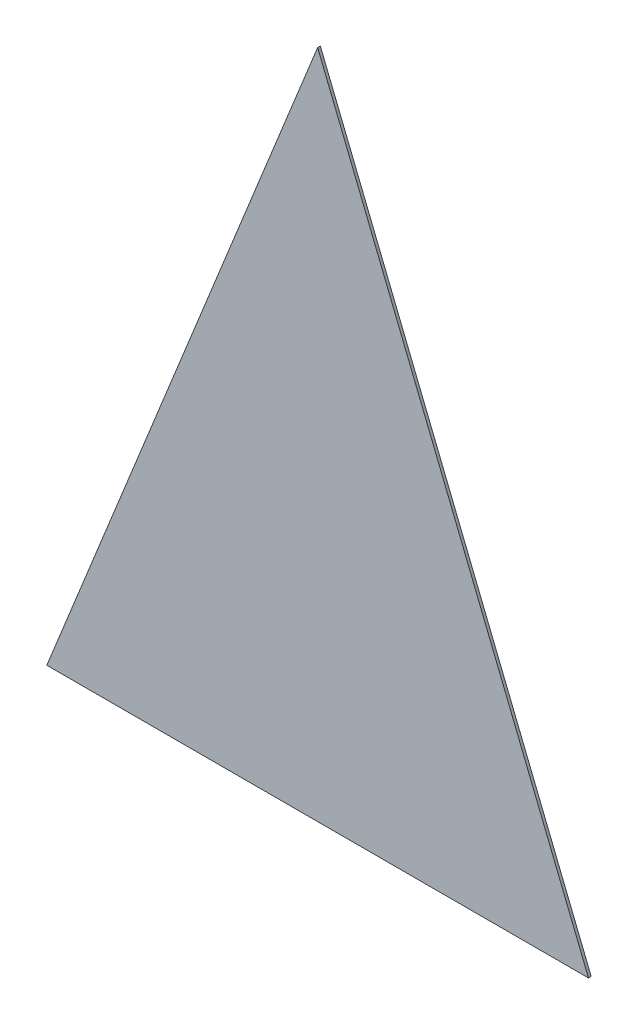
ISO-10303-21;
HEADER;
FILE_DESCRIPTION(('STEP AP214'),'2;1');
FILE_NAME('part.step','',(''),(''),'','','');
FILE_SCHEMA(('AUTOMOTIVE_DESIGN { 1 0 10303 214 1 1 1 1 }'));
ENDSEC;
DATA;
#1=APPLICATION_CONTEXT('core data for automotive mechanical design processes');
#2=APPLICATION_PROTOCOL_DEFINITION('international standard','automotive_design',2000,#1);
#3=PRODUCT_CONTEXT('',#1,'mechanical');
#4=PRODUCT('Part','Part','',(#3));
#5=PRODUCT_RELATED_PRODUCT_CATEGORY('part','',(#4));
#6=PRODUCT_DEFINITION_FORMATION('','',#4);
#7=PRODUCT_DEFINITION_CONTEXT('part definition',#1,'design');
#8=PRODUCT_DEFINITION('design','',#6,#7);
#9=PRODUCT_DEFINITION_SHAPE('','',#8);
#10=(LENGTH_UNIT() NAMED_UNIT(*) SI_UNIT(.MILLI.,.METRE.));
#11=(NAMED_UNIT(*) PLANE_ANGLE_UNIT() SI_UNIT($,.RADIAN.));
#12=(NAMED_UNIT(*) SI_UNIT($,.STERADIAN.) SOLID_ANGLE_UNIT());
#13=UNCERTAINTY_MEASURE_WITH_UNIT(LENGTH_MEASURE(1.E-05),#10,'distance_accuracy_value','');
#14=(GEOMETRIC_REPRESENTATION_CONTEXT(3) GLOBAL_UNCERTAINTY_ASSIGNED_CONTEXT((#13)) GLOBAL_UNIT_ASSIGNED_CONTEXT((#10,
#11,#12)) REPRESENTATION_CONTEXT('',''));
#15=CARTESIAN_POINT('',(0.,0.,0.));
#16=DIRECTION('',(0.,0.,1.));
#17=DIRECTION('',(1.,0.,0.));
#18=AXIS2_PLACEMENT_3D('',#15,#16,#17);
#19=CARTESIAN_POINT('',(0.40203667506545,-0.133284989218475,0.0009));
#20=DIRECTION('',(0.,0.,-1.));
#21=DIRECTION('',(-1.,0.,0.));
#22=AXIS2_PLACEMENT_3D('',#19,#20,#21);
#23=PLANE('',#22);
#24=DIRECTION('',(-1.,0.,0.));
#25=VECTOR('',#24,1.);
#26=CARTESIAN_POINT('',(0.4120667058204,-0.133284989218463,0.0009));
#27=LINE('',#26,#25);
#28=CARTESIAN_POINT('',(0.4120667058204,-0.133284989218463,0.0009));
#29=VERTEX_POINT('',#28);
#30=CARTESIAN_POINT('',(0.3920066443105,-0.133284989218463,0.0009));
#31=VERTEX_POINT('',#30);
#32=EDGE_CURVE('E11',#29,#31,#27,.T.);
#33=ORIENTED_EDGE('',*,*,#32,.T.);
#34=DIRECTION('',(0.374606593417049,0.927183854566328,0.));
#35=VECTOR('',#34,1.);
#36=CARTESIAN_POINT('',(0.3920066443105,-0.133284989218474,0.0009));
#37=LINE('',#36,#35);
#38=CARTESIAN_POINT('',(0.4020366750655,-0.1084597919575,0.0009));
#39=VERTEX_POINT('',#38);
#40=EDGE_CURVE('E24',#31,#39,#37,.T.);
#41=ORIENTED_EDGE('',*,*,#40,.T.);
#42=DIRECTION('',(0.374606593417036,-0.927183854566333,0.));
#43=VECTOR('',#42,1.);
#44=CARTESIAN_POINT('',(0.4020366750654,-0.1084597919575,0.0009));
#45=LINE('',#44,#43);
#46=EDGE_CURVE('E62',#39,#29,#45,.T.);
#47=ORIENTED_EDGE('',*,*,#46,.T.);
#48=EDGE_LOOP('',(#33,#41,#47));
#49=FACE_BOUND('',#48,.T.);
#50=ADVANCED_FACE('F17',(#49),#23,.T.);
#51=CARTESIAN_POINT('',(0.40203667506545,-0.133284989218463,0.0009));
#52=DIRECTION('',(0.,-1.,0.));
#53=DIRECTION('',(0.,0.,-1.));
#54=AXIS2_PLACEMENT_3D('',#51,#52,#53);
#55=PLANE('',#54);
#56=DIRECTION('',(1.,0.,0.));
#57=VECTOR('',#56,1.);
#58=CARTESIAN_POINT('',(0.3920066443105,-0.133284989218463,0.001));
#59=LINE('',#58,#57);
#60=CARTESIAN_POINT('',(0.3920066443105,-0.133284989218463,0.001));
#61=VERTEX_POINT('',#60);
#62=CARTESIAN_POINT('',(0.4120667058204,-0.133284989218463,0.001));
#63=VERTEX_POINT('',#62);
#64=EDGE_CURVE('E53',#61,#63,#59,.T.);
#65=ORIENTED_EDGE('',*,*,#64,.F.);
#66=DIRECTION('',(0.,0.,-1.));
#67=VECTOR('',#66,1.);
#68=CARTESIAN_POINT('',(0.3920066443105,-0.133284989218463,0.001));
#69=LINE('',#68,#67);
#70=EDGE_CURVE('E67',#61,#31,#69,.T.);
#71=ORIENTED_EDGE('',*,*,#70,.T.);
#72=ORIENTED_EDGE('',*,*,#32,.F.);
#73=DIRECTION('',(0.,0.,-1.));
#74=VECTOR('',#73,1.);
#75=CARTESIAN_POINT('',(0.4120667058204,-0.133284989218463,0.001));
#76=LINE('',#75,#74);
#77=EDGE_CURVE('E56',#63,#29,#76,.T.);
#78=ORIENTED_EDGE('',*,*,#77,.F.);
#79=EDGE_LOOP('',(#65,#71,#72,#78));
#80=FACE_BOUND('',#79,.T.);
#81=ADVANCED_FACE('F73',(#80),#55,.T.);
#82=CARTESIAN_POINT('',(0.40705169044295,-0.120872390587982,0.0009));
#83=DIRECTION('',(0.927183854567568,0.37460659341398,0.));
#84=DIRECTION('',(0.,0.,-1.));
#85=AXIS2_PLACEMENT_3D('',#82,#83,#84);
#86=PLANE('',#85);
#87=DIRECTION('',(-0.37460659341398,0.927183854567568,0.));
#88=VECTOR('',#87,1.);
#89=CARTESIAN_POINT('',(0.4120667058204,-0.133284989218463,0.001));
#90=LINE('',#89,#88);
#91=CARTESIAN_POINT('',(0.4020366750655,-0.1084597919575,0.001));
#92=VERTEX_POINT('',#91);
#93=EDGE_CURVE('E48',#63,#92,#90,.T.);
#94=ORIENTED_EDGE('',*,*,#93,.F.);
#95=ORIENTED_EDGE('',*,*,#77,.T.);
#96=ORIENTED_EDGE('',*,*,#46,.F.);
#97=DIRECTION('',(0.,0.,-1.));
#98=VECTOR('',#97,1.);
#99=CARTESIAN_POINT('',(0.4020366750655,-0.1084597919575,0.001));
#100=LINE('',#99,#98);
#101=EDGE_CURVE('E57',#92,#39,#100,.T.);
#102=ORIENTED_EDGE('',*,*,#101,.F.);
#103=EDGE_LOOP('',(#94,#95,#96,#102));
#104=FACE_BOUND('',#103,.T.);
#105=ADVANCED_FACE('F61',(#104),#86,.T.);
#106=CARTESIAN_POINT('',(0.397021659688,-0.120872390587981,0.0009));
#107=DIRECTION('',(-0.92718385456626,0.374606593417217,0.));
#108=DIRECTION('',(0.,0.,1.));
#109=AXIS2_PLACEMENT_3D('',#106,#107,#108);
#110=PLANE('',#109);
#111=DIRECTION('',(-0.374606593417217,-0.92718385456626,0.));
#112=VECTOR('',#111,1.);
#113=CARTESIAN_POINT('',(0.4020366750655,-0.1084597919575,0.001));
#114=LINE('',#113,#112);
#115=EDGE_CURVE('E52',#92,#61,#114,.T.);
#116=ORIENTED_EDGE('',*,*,#115,.F.);
#117=ORIENTED_EDGE('',*,*,#101,.T.);
#118=ORIENTED_EDGE('',*,*,#40,.F.);
#119=ORIENTED_EDGE('',*,*,#70,.F.);
#120=EDGE_LOOP('',(#116,#117,#118,#119));
#121=FACE_BOUND('',#120,.T.);
#122=ADVANCED_FACE('F66',(#121),#110,.T.);
#123=CARTESIAN_POINT('',(0.40203667506545,-0.133284989218463,0.001));
#124=DIRECTION('',(0.,0.,-1.));
#125=DIRECTION('',(-1.,0.,0.));
#126=AXIS2_PLACEMENT_3D('',#123,#124,#125);
#127=PLANE('',#126);
#128=ORIENTED_EDGE('',*,*,#93,.T.);
#129=ORIENTED_EDGE('',*,*,#115,.T.);
#130=ORIENTED_EDGE('',*,*,#64,.T.);
#131=EDGE_LOOP('',(#128,#129,#130));
#132=FACE_BOUND('',#131,.T.);
#133=ADVANCED_FACE('F50',(#132),#127,.F.);
#134=CLOSED_SHELL('',(#50,#81,#105,#122,#133));
#135=MANIFOLD_SOLID_BREP('B1',#134);
#136=ADVANCED_BREP_SHAPE_REPRESENTATION('',(#18,#135),#14);
#137=SHAPE_DEFINITION_REPRESENTATION(#9,#136);
ENDSEC;
END-ISO-10303-21;
